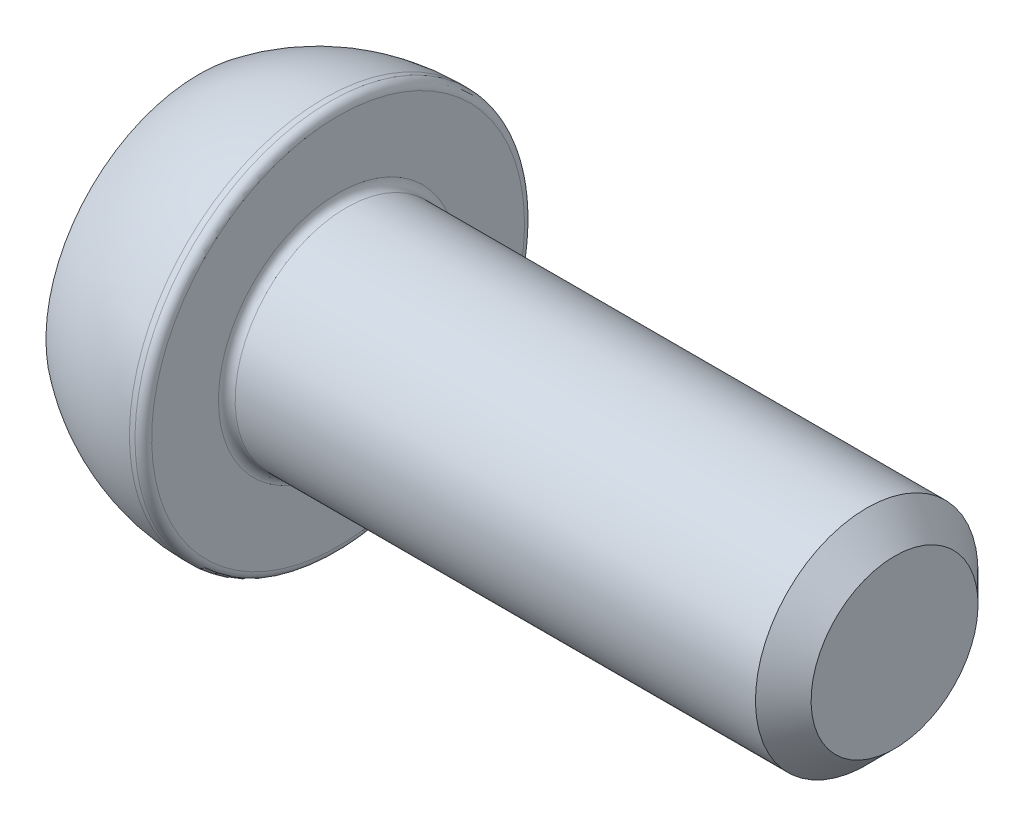
ISO-10303-21;
HEADER;
FILE_DESCRIPTION(('STEP AP214'),'2;1');
FILE_NAME('part.step','',(''),(''),'','','');
FILE_SCHEMA(('AUTOMOTIVE_DESIGN { 1 0 10303 214 1 1 1 1 }'));
ENDSEC;
DATA;
#1=APPLICATION_CONTEXT('core data for automotive mechanical design processes');
#2=APPLICATION_PROTOCOL_DEFINITION('international standard','automotive_design',2000,#1);
#3=PRODUCT_CONTEXT('',#1,'mechanical');
#4=PRODUCT('Part','Part','',(#3));
#5=PRODUCT_RELATED_PRODUCT_CATEGORY('part','',(#4));
#6=PRODUCT_DEFINITION_FORMATION('','',#4);
#7=PRODUCT_DEFINITION_CONTEXT('part definition',#1,'design');
#8=PRODUCT_DEFINITION('design','',#6,#7);
#9=PRODUCT_DEFINITION_SHAPE('','',#8);
#10=(LENGTH_UNIT() NAMED_UNIT(*) SI_UNIT(.MILLI.,.METRE.));
#11=(NAMED_UNIT(*) PLANE_ANGLE_UNIT() SI_UNIT($,.RADIAN.));
#12=(NAMED_UNIT(*) SI_UNIT($,.STERADIAN.) SOLID_ANGLE_UNIT());
#13=UNCERTAINTY_MEASURE_WITH_UNIT(LENGTH_MEASURE(1.E-05),#10,'distance_accuracy_value','');
#14=(GEOMETRIC_REPRESENTATION_CONTEXT(3) GLOBAL_UNCERTAINTY_ASSIGNED_CONTEXT((#13)) GLOBAL_UNIT_ASSIGNED_CONTEXT((#10,
#11,#12)) REPRESENTATION_CONTEXT('',''));
#15=CARTESIAN_POINT('',(0.,0.,0.));
#16=DIRECTION('',(0.,0.,1.));
#17=DIRECTION('',(1.,0.,0.));
#18=AXIS2_PLACEMENT_3D('',#15,#16,#17);
#19=CARTESIAN_POINT('',(0.,0.,0.));
#20=DIRECTION('',(-1.,0.,0.));
#21=DIRECTION('',(0.,-1.,0.));
#22=AXIS2_PLACEMENT_3D('',#19,#20,#21);
#23=PLANE('',#22);
#24=DIRECTION('',(0.,0.866025403784438,-0.5));
#25=VECTOR('',#24,1.);
#26=CARTESIAN_POINT('',(0.,0.,3.46410161513775));
#27=LINE('',#26,#25);
#28=CARTESIAN_POINT('',(0.,0.,3.46410161513775));
#29=VERTEX_POINT('',#28);
#30=CARTESIAN_POINT('',(0.,3.,1.73205080756888));
#31=VERTEX_POINT('',#30);
#32=EDGE_CURVE('E64',#29,#31,#27,.T.);
#33=ORIENTED_EDGE('',*,*,#32,.F.);
#34=DIRECTION('',(0.,0.866025403784438,0.5));
#35=VECTOR('',#34,1.);
#36=CARTESIAN_POINT('',(0.,-3.,1.73205080756888));
#37=LINE('',#36,#35);
#38=CARTESIAN_POINT('',(0.,-3.,1.73205080756888));
#39=VERTEX_POINT('',#38);
#40=EDGE_CURVE('E147',#39,#29,#37,.T.);
#41=ORIENTED_EDGE('',*,*,#40,.F.);
#42=DIRECTION('',(0.,0.,1.));
#43=VECTOR('',#42,1.);
#44=CARTESIAN_POINT('',(0.,-3.,-1.73205080756888));
#45=LINE('',#44,#43);
#46=CARTESIAN_POINT('',(0.,-3.,-1.73205080756888));
#47=VERTEX_POINT('',#46);
#48=EDGE_CURVE('E145',#47,#39,#45,.T.);
#49=ORIENTED_EDGE('',*,*,#48,.F.);
#50=DIRECTION('',(0.,-0.866025403784438,0.5));
#51=VECTOR('',#50,1.);
#52=CARTESIAN_POINT('',(0.,0.,-3.46410161513775));
#53=LINE('',#52,#51);
#54=CARTESIAN_POINT('',(0.,0.,-3.46410161513775));
#55=VERTEX_POINT('',#54);
#56=EDGE_CURVE('E112',#55,#47,#53,.T.);
#57=ORIENTED_EDGE('',*,*,#56,.F.);
#58=DIRECTION('',(0.,-0.866025403784439,-0.5));
#59=VECTOR('',#58,1.);
#60=CARTESIAN_POINT('',(0.,3.,-1.73205080756888));
#61=LINE('',#60,#59);
#62=CARTESIAN_POINT('',(0.,3.,-1.73205080756888));
#63=VERTEX_POINT('',#62);
#64=EDGE_CURVE('E141',#63,#55,#61,.T.);
#65=ORIENTED_EDGE('',*,*,#64,.F.);
#66=DIRECTION('',(0.,0.,-1.));
#67=VECTOR('',#66,1.);
#68=CARTESIAN_POINT('',(0.,3.,1.73205080756888));
#69=LINE('',#68,#67);
#70=EDGE_CURVE('E138',#31,#63,#69,.T.);
#71=ORIENTED_EDGE('',*,*,#70,.F.);
#72=EDGE_LOOP('',(#33,#41,#49,#57,#65,#71));
#73=FACE_BOUND('',#72,.T.);
#74=CARTESIAN_POINT('',(0.,0.,0.));
#75=DIRECTION('',(1.,0.,0.));
#76=DIRECTION('',(0.,1.,0.));
#77=AXIS2_PLACEMENT_3D('',#74,#75,#76);
#78=CIRCLE('',#77,5.5);
#79=CARTESIAN_POINT('',(0.,5.5,0.));
#80=VERTEX_POINT('',#79);
#81=EDGE_CURVE('E159',#80,#80,#78,.T.);
#82=ORIENTED_EDGE('',*,*,#81,.F.);
#83=EDGE_LOOP('',(#82));
#84=FACE_BOUND('',#83,.T.);
#85=ADVANCED_FACE('F48',(#73,#84),#23,.T.);
#86=CARTESIAN_POINT('',(4.5,0.,0.));
#87=DIRECTION('',(1.,0.,0.));
#88=DIRECTION('',(0.,1.,0.));
#89=AXIS2_PLACEMENT_3D('',#86,#87,#88);
#90=DEGENERATE_TOROIDAL_SURFACE('',#89,0.500000000000003,7.5,.F.);
#91=ORIENTED_EDGE('',*,*,#81,.T.);
#92=EDGE_LOOP('',(#91));
#93=FACE_BOUND('',#92,.T.);
#94=CARTESIAN_POINT('',(4.5,0.,0.));
#95=DIRECTION('',(1.,0.,0.));
#96=DIRECTION('',(0.,1.,0.));
#97=AXIS2_PLACEMENT_3D('',#94,#95,#96);
#98=CIRCLE('',#97,7.);
#99=CARTESIAN_POINT('',(4.5,7.,0.));
#100=VERTEX_POINT('',#99);
#101=EDGE_CURVE('E151',#100,#100,#98,.T.);
#102=ORIENTED_EDGE('',*,*,#101,.F.);
#103=EDGE_LOOP('',(#102));
#104=FACE_BOUND('',#103,.T.);
#105=ADVANCED_FACE('F188',(#93,#104),#90,.F.);
#106=CARTESIAN_POINT('',(25.,0.,0.));
#107=DIRECTION('',(1.,0.,0.));
#108=DIRECTION('',(0.,1.,0.));
#109=AXIS2_PLACEMENT_3D('',#106,#107,#108);
#110=CYLINDRICAL_SURFACE('',#109,7.);
#111=CARTESIAN_POINT('',(4.7,0.,0.));
#112=DIRECTION('',(1.,0.,0.));
#113=DIRECTION('',(0.,1.,0.));
#114=AXIS2_PLACEMENT_3D('',#111,#112,#113);
#115=CIRCLE('',#114,7.);
#116=CARTESIAN_POINT('',(4.7,7.,0.));
#117=VERTEX_POINT('',#116);
#118=EDGE_CURVE('E171',#117,#117,#115,.F.);
#119=ORIENTED_EDGE('',*,*,#118,.T.);
#120=EDGE_LOOP('',(#119));
#121=FACE_BOUND('',#120,.T.);
#122=ORIENTED_EDGE('',*,*,#101,.T.);
#123=EDGE_LOOP('',(#122));
#124=FACE_BOUND('',#123,.T.);
#125=ADVANCED_FACE('F194',(#121,#124),#110,.T.);
#126=CARTESIAN_POINT('',(5.,7.,0.));
#127=DIRECTION('',(1.,0.,0.));
#128=DIRECTION('',(0.,1.,0.));
#129=AXIS2_PLACEMENT_3D('',#126,#127,#128);
#130=PLANE('',#129);
#131=CARTESIAN_POINT('',(5.,0.,0.));
#132=DIRECTION('',(1.,0.,0.));
#133=DIRECTION('',(0.,1.,0.));
#134=AXIS2_PLACEMENT_3D('',#131,#132,#133);
#135=CIRCLE('',#134,4.3);
#136=CARTESIAN_POINT('',(5.,4.3,0.));
#137=VERTEX_POINT('',#136);
#138=EDGE_CURVE('E168',#137,#137,#135,.F.);
#139=ORIENTED_EDGE('',*,*,#138,.T.);
#140=EDGE_LOOP('',(#139));
#141=FACE_BOUND('',#140,.T.);
#142=CARTESIAN_POINT('',(5.,0.,0.));
#143=DIRECTION('',(1.,0.,0.));
#144=DIRECTION('',(0.,1.,0.));
#145=AXIS2_PLACEMENT_3D('',#142,#143,#144);
#146=CIRCLE('',#145,6.7);
#147=CARTESIAN_POINT('',(5.,6.7,0.));
#148=VERTEX_POINT('',#147);
#149=EDGE_CURVE('E165',#148,#148,#146,.T.);
#150=ORIENTED_EDGE('',*,*,#149,.T.);
#151=EDGE_LOOP('',(#150));
#152=FACE_BOUND('',#151,.T.);
#153=ADVANCED_FACE('F213',(#141,#152),#130,.T.);
#154=CARTESIAN_POINT('',(25.,0.,0.));
#155=DIRECTION('',(1.,0.,0.));
#156=DIRECTION('',(0.,1.,0.));
#157=AXIS2_PLACEMENT_3D('',#154,#155,#156);
#158=CYLINDRICAL_SURFACE('',#157,4.);
#159=CARTESIAN_POINT('',(24.,0.,0.));
#160=DIRECTION('',(1.,0.,0.));
#161=DIRECTION('',(0.,1.,0.));
#162=AXIS2_PLACEMENT_3D('',#159,#160,#161);
#163=CIRCLE('',#162,4.);
#164=CARTESIAN_POINT('',(24.,4.,0.));
#165=VERTEX_POINT('',#164);
#166=EDGE_CURVE('E13',#165,#165,#163,.F.);
#167=ORIENTED_EDGE('',*,*,#166,.T.);
#168=EDGE_LOOP('',(#167));
#169=FACE_BOUND('',#168,.T.);
#170=CARTESIAN_POINT('',(5.3,0.,0.));
#171=DIRECTION('',(1.,0.,0.));
#172=DIRECTION('',(0.,1.,0.));
#173=AXIS2_PLACEMENT_3D('',#170,#171,#172);
#174=CIRCLE('',#173,4.);
#175=CARTESIAN_POINT('',(5.3,4.,0.));
#176=VERTEX_POINT('',#175);
#177=EDGE_CURVE('E162',#176,#176,#174,.T.);
#178=ORIENTED_EDGE('',*,*,#177,.T.);
#179=EDGE_LOOP('',(#178));
#180=FACE_BOUND('',#179,.T.);
#181=ADVANCED_FACE('F211',(#169,#180),#158,.T.);
#182=CARTESIAN_POINT('',(25.,4.,0.));
#183=DIRECTION('',(1.,0.,0.));
#184=DIRECTION('',(0.,1.,0.));
#185=AXIS2_PLACEMENT_3D('',#182,#183,#184);
#186=PLANE('',#185);
#187=CARTESIAN_POINT('',(25.,0.,0.));
#188=DIRECTION('',(1.,0.,0.));
#189=DIRECTION('',(0.,1.,0.));
#190=AXIS2_PLACEMENT_3D('',#187,#188,#189);
#191=CIRCLE('',#190,3.);
#192=CARTESIAN_POINT('',(25.,3.,0.));
#193=VERTEX_POINT('',#192);
#194=EDGE_CURVE('E57',#193,#193,#191,.T.);
#195=ORIENTED_EDGE('',*,*,#194,.T.);
#196=EDGE_LOOP('',(#195));
#197=FACE_BOUND('',#196,.T.);
#198=ADVANCED_FACE('F176',(#197),#186,.T.);
#199=CARTESIAN_POINT('',(3.,0.,3.46410161513775));
#200=DIRECTION('',(0.,0.5,0.866025403784439));
#201=DIRECTION('',(0.,-0.866025403784439,0.5));
#202=AXIS2_PLACEMENT_3D('',#199,#200,#201);
#203=PLANE('',#202);
#204=ORIENTED_EDGE('',*,*,#32,.T.);
#205=DIRECTION('',(-1.,0.,0.));
#206=VECTOR('',#205,1.);
#207=CARTESIAN_POINT('',(3.,3.,1.73205080756888));
#208=LINE('',#207,#206);
#209=CARTESIAN_POINT('',(3.,3.,1.73205080756888));
#210=VERTEX_POINT('',#209);
#211=EDGE_CURVE('E94',#210,#31,#208,.T.);
#212=ORIENTED_EDGE('',*,*,#211,.F.);
#213=DIRECTION('',(0.,0.866025403784438,-0.5));
#214=VECTOR('',#213,1.);
#215=CARTESIAN_POINT('',(3.,0.,3.46410161513775));
#216=LINE('',#215,#214);
#217=CARTESIAN_POINT('',(3.,0.,3.46410161513775));
#218=VERTEX_POINT('',#217);
#219=EDGE_CURVE('E149',#218,#210,#216,.T.);
#220=ORIENTED_EDGE('',*,*,#219,.F.);
#221=DIRECTION('',(-1.,0.,0.));
#222=VECTOR('',#221,1.);
#223=CARTESIAN_POINT('',(3.,0.,3.46410161513775));
#224=LINE('',#223,#222);
#225=EDGE_CURVE('E72',#218,#29,#224,.T.);
#226=ORIENTED_EDGE('',*,*,#225,.T.);
#227=EDGE_LOOP('',(#204,#212,#220,#226));
#228=FACE_BOUND('',#227,.T.);
#229=ADVANCED_FACE('F220',(#228),#203,.F.);
#230=CARTESIAN_POINT('',(3.,-3.,1.73205080756888));
#231=DIRECTION('',(0.,-0.5,0.866025403784439));
#232=DIRECTION('',(0.,-0.866025403784439,-0.5));
#233=AXIS2_PLACEMENT_3D('',#230,#231,#232);
#234=PLANE('',#233);
#235=ORIENTED_EDGE('',*,*,#40,.T.);
#236=ORIENTED_EDGE('',*,*,#225,.F.);
#237=DIRECTION('',(0.,0.866025403784438,0.5));
#238=VECTOR('',#237,1.);
#239=CARTESIAN_POINT('',(3.,-3.,1.73205080756888));
#240=LINE('',#239,#238);
#241=CARTESIAN_POINT('',(3.,-3.,1.73205080756888));
#242=VERTEX_POINT('',#241);
#243=EDGE_CURVE('E124',#242,#218,#240,.T.);
#244=ORIENTED_EDGE('',*,*,#243,.F.);
#245=DIRECTION('',(-1.,0.,0.));
#246=VECTOR('',#245,1.);
#247=CARTESIAN_POINT('',(3.,-3.,1.73205080756888));
#248=LINE('',#247,#246);
#249=EDGE_CURVE('E116',#242,#39,#248,.T.);
#250=ORIENTED_EDGE('',*,*,#249,.T.);
#251=EDGE_LOOP('',(#235,#236,#244,#250));
#252=FACE_BOUND('',#251,.T.);
#253=ADVANCED_FACE('F277',(#252),#234,.F.);
#254=CARTESIAN_POINT('',(3.,-3.,-1.73205080756888));
#255=DIRECTION('',(0.,-1.,0.));
#256=DIRECTION('',(0.,0.,-1.));
#257=AXIS2_PLACEMENT_3D('',#254,#255,#256);
#258=PLANE('',#257);
#259=ORIENTED_EDGE('',*,*,#48,.T.);
#260=ORIENTED_EDGE('',*,*,#249,.F.);
#261=DIRECTION('',(0.,0.,1.));
#262=VECTOR('',#261,1.);
#263=CARTESIAN_POINT('',(3.,-3.,-1.73205080756888));
#264=LINE('',#263,#262);
#265=CARTESIAN_POINT('',(3.,-3.,-1.73205080756888));
#266=VERTEX_POINT('',#265);
#267=EDGE_CURVE('E120',#266,#242,#264,.T.);
#268=ORIENTED_EDGE('',*,*,#267,.F.);
#269=DIRECTION('',(-1.,0.,0.));
#270=VECTOR('',#269,1.);
#271=CARTESIAN_POINT('',(3.,-3.,-1.73205080756888));
#272=LINE('',#271,#270);
#273=EDGE_CURVE('E105',#266,#47,#272,.T.);
#274=ORIENTED_EDGE('',*,*,#273,.T.);
#275=EDGE_LOOP('',(#259,#260,#268,#274));
#276=FACE_BOUND('',#275,.T.);
#277=ADVANCED_FACE('F121',(#276),#258,.F.);
#278=CARTESIAN_POINT('',(3.,0.,-3.46410161513775));
#279=DIRECTION('',(0.,-0.5,-0.866025403784439));
#280=DIRECTION('',(0.,0.866025403784439,-0.5));
#281=AXIS2_PLACEMENT_3D('',#278,#279,#280);
#282=PLANE('',#281);
#283=ORIENTED_EDGE('',*,*,#56,.T.);
#284=ORIENTED_EDGE('',*,*,#273,.F.);
#285=DIRECTION('',(0.,-0.866025403784438,0.5));
#286=VECTOR('',#285,1.);
#287=CARTESIAN_POINT('',(3.,0.,-3.46410161513775));
#288=LINE('',#287,#286);
#289=CARTESIAN_POINT('',(3.,0.,-3.46410161513775));
#290=VERTEX_POINT('',#289);
#291=EDGE_CURVE('E109',#290,#266,#288,.T.);
#292=ORIENTED_EDGE('',*,*,#291,.F.);
#293=DIRECTION('',(-1.,0.,0.));
#294=VECTOR('',#293,1.);
#295=CARTESIAN_POINT('',(3.,0.,-3.46410161513775));
#296=LINE('',#295,#294);
#297=EDGE_CURVE('E117',#290,#55,#296,.T.);
#298=ORIENTED_EDGE('',*,*,#297,.T.);
#299=EDGE_LOOP('',(#283,#284,#292,#298));
#300=FACE_BOUND('',#299,.T.);
#301=ADVANCED_FACE('F107',(#300),#282,.F.);
#302=CARTESIAN_POINT('',(3.,3.,-1.73205080756888));
#303=DIRECTION('',(0.,0.5,-0.866025403784439));
#304=DIRECTION('',(0.,0.866025403784439,0.5));
#305=AXIS2_PLACEMENT_3D('',#302,#303,#304);
#306=PLANE('',#305);
#307=ORIENTED_EDGE('',*,*,#64,.T.);
#308=ORIENTED_EDGE('',*,*,#297,.F.);
#309=DIRECTION('',(0.,-0.866025403784439,-0.5));
#310=VECTOR('',#309,1.);
#311=CARTESIAN_POINT('',(3.,3.,-1.73205080756888));
#312=LINE('',#311,#310);
#313=CARTESIAN_POINT('',(3.,3.,-1.73205080756888));
#314=VERTEX_POINT('',#313);
#315=EDGE_CURVE('E130',#314,#290,#312,.T.);
#316=ORIENTED_EDGE('',*,*,#315,.F.);
#317=DIRECTION('',(-1.,0.,0.));
#318=VECTOR('',#317,1.);
#319=CARTESIAN_POINT('',(3.,3.,-1.73205080756888));
#320=LINE('',#319,#318);
#321=EDGE_CURVE('E154',#314,#63,#320,.T.);
#322=ORIENTED_EDGE('',*,*,#321,.T.);
#323=EDGE_LOOP('',(#307,#308,#316,#322));
#324=FACE_BOUND('',#323,.T.);
#325=ADVANCED_FACE('F294',(#324),#306,.F.);
#326=CARTESIAN_POINT('',(3.,3.,1.73205080756888));
#327=DIRECTION('',(0.,1.,0.));
#328=DIRECTION('',(0.,0.,1.));
#329=AXIS2_PLACEMENT_3D('',#326,#327,#328);
#330=PLANE('',#329);
#331=ORIENTED_EDGE('',*,*,#70,.T.);
#332=ORIENTED_EDGE('',*,*,#321,.F.);
#333=DIRECTION('',(0.,0.,-1.));
#334=VECTOR('',#333,1.);
#335=CARTESIAN_POINT('',(3.,3.,1.73205080756888));
#336=LINE('',#335,#334);
#337=EDGE_CURVE('E132',#210,#314,#336,.T.);
#338=ORIENTED_EDGE('',*,*,#337,.F.);
#339=ORIENTED_EDGE('',*,*,#211,.T.);
#340=EDGE_LOOP('',(#331,#332,#338,#339));
#341=FACE_BOUND('',#340,.T.);
#342=ADVANCED_FACE('F205',(#341),#330,.F.);
#343=CARTESIAN_POINT('',(3.,0.,0.));
#344=DIRECTION('',(-1.,0.,0.));
#345=DIRECTION('',(0.,0.,1.));
#346=AXIS2_PLACEMENT_3D('',#343,#344,#345);
#347=PLANE('',#346);
#348=ORIENTED_EDGE('',*,*,#219,.T.);
#349=ORIENTED_EDGE('',*,*,#337,.T.);
#350=ORIENTED_EDGE('',*,*,#315,.T.);
#351=ORIENTED_EDGE('',*,*,#291,.T.);
#352=ORIENTED_EDGE('',*,*,#267,.T.);
#353=ORIENTED_EDGE('',*,*,#243,.T.);
#354=EDGE_LOOP('',(#348,#349,#350,#351,#352,#353));
#355=FACE_BOUND('',#354,.T.);
#356=ADVANCED_FACE('F127',(#355),#347,.T.);
#357=CARTESIAN_POINT('',(5.3,0.,0.));
#358=DIRECTION('',(1.,0.,0.));
#359=DIRECTION('',(0.,1.,0.));
#360=AXIS2_PLACEMENT_3D('',#357,#358,#359);
#361=TOROIDAL_SURFACE('',#360,4.3,0.3);
#362=ORIENTED_EDGE('',*,*,#138,.F.);
#363=EDGE_LOOP('',(#362));
#364=FACE_BOUND('',#363,.T.);
#365=ORIENTED_EDGE('',*,*,#177,.F.);
#366=EDGE_LOOP('',(#365));
#367=FACE_BOUND('',#366,.T.);
#368=ADVANCED_FACE('F184',(#364,#367),#361,.F.);
#369=CARTESIAN_POINT('',(4.7,0.,0.));
#370=DIRECTION('',(1.,0.,0.));
#371=DIRECTION('',(0.,1.,0.));
#372=AXIS2_PLACEMENT_3D('',#369,#370,#371);
#373=TOROIDAL_SURFACE('',#372,6.7,0.3);
#374=ORIENTED_EDGE('',*,*,#118,.F.);
#375=EDGE_LOOP('',(#374));
#376=FACE_BOUND('',#375,.T.);
#377=ORIENTED_EDGE('',*,*,#149,.F.);
#378=EDGE_LOOP('',(#377));
#379=FACE_BOUND('',#378,.T.);
#380=ADVANCED_FACE('F179',(#376,#379),#373,.T.);
#381=CARTESIAN_POINT('',(25.,0.,0.));
#382=DIRECTION('',(-1.,0.,0.));
#383=DIRECTION('',(0.,-1.,0.));
#384=AXIS2_PLACEMENT_3D('',#381,#382,#383);
#385=CONICAL_SURFACE('',#384,3.,0.785398163397447);
#386=ORIENTED_EDGE('',*,*,#166,.F.);
#387=EDGE_LOOP('',(#386));
#388=FACE_BOUND('',#387,.T.);
#389=ORIENTED_EDGE('',*,*,#194,.F.);
#390=EDGE_LOOP('',(#389));
#391=FACE_BOUND('',#390,.T.);
#392=ADVANCED_FACE('F51',(#388,#391),#385,.T.);
#393=CLOSED_SHELL('',(#85,#105,#125,#153,#181,#198,#229,#253,#277,#301,#325,#342,#356,#368,#380,#392));
#394=MANIFOLD_SOLID_BREP('B2',#393);
#395=ADVANCED_BREP_SHAPE_REPRESENTATION('',(#18,#394),#14);
#396=SHAPE_DEFINITION_REPRESENTATION(#9,#395);
ENDSEC;
END-ISO-10303-21;
